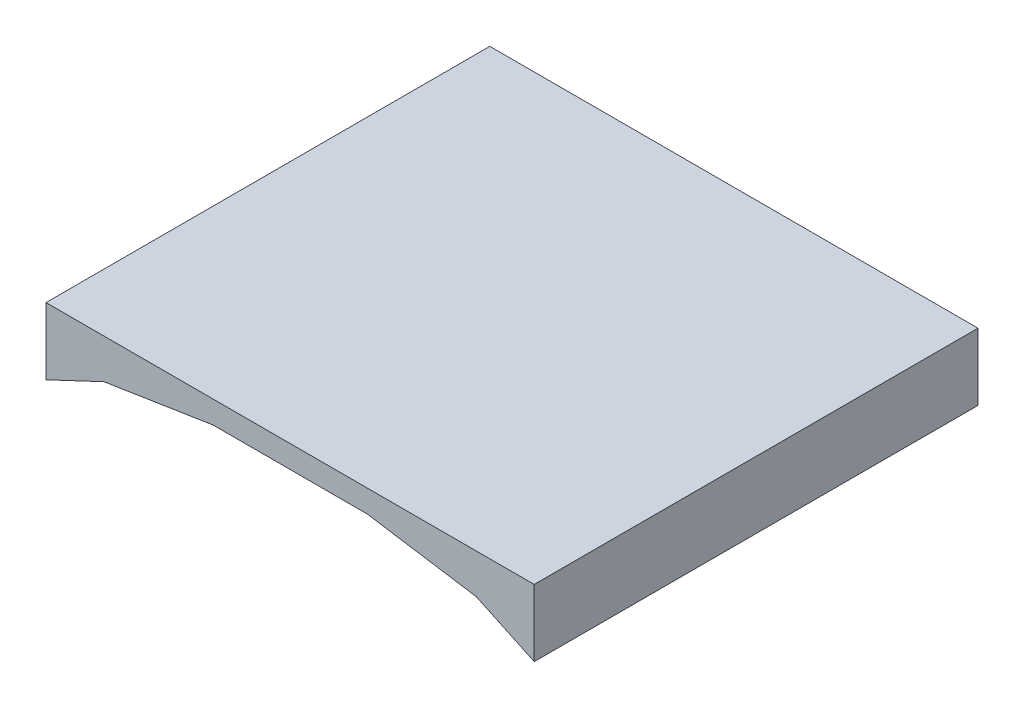
ISO-10303-21;
HEADER;
FILE_DESCRIPTION(('STEP AP214'),'2;1');
FILE_NAME('part.step','',(''),(''),'','','');
FILE_SCHEMA(('AUTOMOTIVE_DESIGN { 1 0 10303 214 1 1 1 1 }'));
ENDSEC;
DATA;
#1=APPLICATION_CONTEXT('core data for automotive mechanical design processes');
#2=APPLICATION_PROTOCOL_DEFINITION('international standard','automotive_design',2000,#1);
#3=PRODUCT_CONTEXT('',#1,'mechanical');
#4=PRODUCT('Part','Part','',(#3));
#5=PRODUCT_RELATED_PRODUCT_CATEGORY('part','',(#4));
#6=PRODUCT_DEFINITION_FORMATION('','',#4);
#7=PRODUCT_DEFINITION_CONTEXT('part definition',#1,'design');
#8=PRODUCT_DEFINITION('design','',#6,#7);
#9=PRODUCT_DEFINITION_SHAPE('','',#8);
#10=(LENGTH_UNIT() NAMED_UNIT(*) SI_UNIT(.MILLI.,.METRE.));
#11=(NAMED_UNIT(*) PLANE_ANGLE_UNIT() SI_UNIT($,.RADIAN.));
#12=(NAMED_UNIT(*) SI_UNIT($,.STERADIAN.) SOLID_ANGLE_UNIT());
#13=UNCERTAINTY_MEASURE_WITH_UNIT(LENGTH_MEASURE(1.E-05),#10,'distance_accuracy_value','');
#14=(GEOMETRIC_REPRESENTATION_CONTEXT(3) GLOBAL_UNCERTAINTY_ASSIGNED_CONTEXT((#13)) GLOBAL_UNIT_ASSIGNED_CONTEXT((#10,
#11,#12)) REPRESENTATION_CONTEXT('',''));
#15=CARTESIAN_POINT('',(0.,0.,0.));
#16=DIRECTION('',(0.,0.,1.));
#17=DIRECTION('',(1.,0.,0.));
#18=AXIS2_PLACEMENT_3D('',#15,#16,#17);
#19=CARTESIAN_POINT('',(-27.5,0.,50.));
#20=DIRECTION('',(1.,0.,0.));
#21=DIRECTION('',(0.,0.,-1.));
#22=AXIS2_PLACEMENT_3D('',#19,#20,#21);
#23=PLANE('',#22);
#24=DIRECTION('',(0.,-1.,0.));
#25=VECTOR('',#24,1.);
#26=CARTESIAN_POINT('',(-27.5,0.,0.));
#27=LINE('',#26,#25);
#28=CARTESIAN_POINT('',(-27.5,7.53596764182063,0.));
#29=VERTEX_POINT('',#28);
#30=CARTESIAN_POINT('',(-27.5,0.,0.));
#31=VERTEX_POINT('',#30);
#32=EDGE_CURVE('E129',#29,#31,#27,.T.);
#33=ORIENTED_EDGE('',*,*,#32,.T.);
#34=DIRECTION('',(0.,0.,-1.));
#35=VECTOR('',#34,1.);
#36=CARTESIAN_POINT('',(-27.5,0.,50.));
#37=LINE('',#36,#35);
#38=CARTESIAN_POINT('',(-27.5,0.,50.));
#39=VERTEX_POINT('',#38);
#40=EDGE_CURVE('E11',#39,#31,#37,.T.);
#41=ORIENTED_EDGE('',*,*,#40,.F.);
#42=DIRECTION('',(0.,-1.,0.));
#43=VECTOR('',#42,1.);
#44=CARTESIAN_POINT('',(-27.5,0.,50.));
#45=LINE('',#44,#43);
#46=CARTESIAN_POINT('',(-27.5,7.53596764182063,50.));
#47=VERTEX_POINT('',#46);
#48=EDGE_CURVE('E143',#47,#39,#45,.T.);
#49=ORIENTED_EDGE('',*,*,#48,.F.);
#50=DIRECTION('',(0.,0.,-1.));
#51=VECTOR('',#50,1.);
#52=CARTESIAN_POINT('',(-27.5,7.53596764182063,50.));
#53=LINE('',#52,#51);
#54=EDGE_CURVE('E125',#47,#29,#53,.T.);
#55=ORIENTED_EDGE('',*,*,#54,.T.);
#56=EDGE_LOOP('',(#33,#41,#49,#55));
#57=FACE_BOUND('',#56,.T.);
#58=ADVANCED_FACE('F33',(#57),#23,.F.);
#59=CARTESIAN_POINT('',(-27.5,0.,50.));
#60=DIRECTION('',(-0.426558237939907,0.90446009842646,0.));
#61=DIRECTION('',(-0.90446009842646,-0.426558237939907,0.));
#62=AXIS2_PLACEMENT_3D('',#59,#60,#61);
#63=PLANE('',#62);
#64=DIRECTION('',(0.90446009842646,0.426558237939907,0.));
#65=VECTOR('',#64,1.);
#66=CARTESIAN_POINT('',(-27.5,0.,0.));
#67=LINE('',#66,#65);
#68=CARTESIAN_POINT('',(-20.9806556570003,3.07462987069468,0.));
#69=VERTEX_POINT('',#68);
#70=EDGE_CURVE('E132',#31,#69,#67,.T.);
#71=ORIENTED_EDGE('',*,*,#70,.T.);
#72=DIRECTION('',(0.,0.,-1.));
#73=VECTOR('',#72,1.);
#74=CARTESIAN_POINT('',(-20.9806556570003,3.07462987069468,50.));
#75=LINE('',#74,#73);
#76=CARTESIAN_POINT('',(-20.9806556570003,3.07462987069468,50.));
#77=VERTEX_POINT('',#76);
#78=EDGE_CURVE('E41',#77,#69,#75,.T.);
#79=ORIENTED_EDGE('',*,*,#78,.F.);
#80=DIRECTION('',(0.90446009842646,0.426558237939907,0.));
#81=VECTOR('',#80,1.);
#82=CARTESIAN_POINT('',(-27.5,0.,50.));
#83=LINE('',#82,#81);
#84=EDGE_CURVE('E92',#39,#77,#83,.T.);
#85=ORIENTED_EDGE('',*,*,#84,.F.);
#86=ORIENTED_EDGE('',*,*,#40,.T.);
#87=EDGE_LOOP('',(#71,#79,#85,#86));
#88=FACE_BOUND('',#87,.T.);
#89=ADVANCED_FACE('F178',(#88),#63,.F.);
#90=CARTESIAN_POINT('',(-20.9806556570003,3.07462987069468,50.));
#91=DIRECTION('',(-0.154704315530748,0.987960816407292,0.));
#92=DIRECTION('',(-0.987960816407292,-0.154704315530748,0.));
#93=AXIS2_PLACEMENT_3D('',#90,#91,#92);
#94=PLANE('',#93);
#95=DIRECTION('',(0.987960816407292,0.154704315530748,0.));
#96=VECTOR('',#95,1.);
#97=CARTESIAN_POINT('',(-20.9806556570003,3.07462987069468,0.));
#98=LINE('',#97,#96);
#99=CARTESIAN_POINT('',(-8.68500483233645,5.,0.));
#100=VERTEX_POINT('',#99);
#101=EDGE_CURVE('E134',#69,#100,#98,.T.);
#102=ORIENTED_EDGE('',*,*,#101,.T.);
#103=DIRECTION('',(0.,0.,-1.));
#104=VECTOR('',#103,1.);
#105=CARTESIAN_POINT('',(-8.68500483233645,5.,50.));
#106=LINE('',#105,#104);
#107=CARTESIAN_POINT('',(-8.68500483233645,5.,50.));
#108=VERTEX_POINT('',#107);
#109=EDGE_CURVE('E150',#108,#100,#106,.T.);
#110=ORIENTED_EDGE('',*,*,#109,.F.);
#111=DIRECTION('',(0.987960816407292,0.154704315530748,0.));
#112=VECTOR('',#111,1.);
#113=CARTESIAN_POINT('',(-20.9806556570003,3.07462987069468,50.));
#114=LINE('',#113,#112);
#115=EDGE_CURVE('E158',#77,#108,#114,.T.);
#116=ORIENTED_EDGE('',*,*,#115,.F.);
#117=ORIENTED_EDGE('',*,*,#78,.T.);
#118=EDGE_LOOP('',(#102,#110,#116,#117));
#119=FACE_BOUND('',#118,.T.);
#120=ADVANCED_FACE('F156',(#119),#94,.F.);
#121=CARTESIAN_POINT('',(-8.68500483233645,5.,50.));
#122=DIRECTION('',(0.,1.,0.));
#123=DIRECTION('',(0.,0.,1.));
#124=AXIS2_PLACEMENT_3D('',#121,#122,#123);
#125=PLANE('',#124);
#126=DIRECTION('',(1.,0.,0.));
#127=VECTOR('',#126,1.);
#128=CARTESIAN_POINT('',(-8.68500483233645,5.,0.));
#129=LINE('',#128,#127);
#130=CARTESIAN_POINT('',(8.68500483233645,5.,0.));
#131=VERTEX_POINT('',#130);
#132=EDGE_CURVE('E136',#100,#131,#129,.T.);
#133=ORIENTED_EDGE('',*,*,#132,.T.);
#134=DIRECTION('',(0.,0.,-1.));
#135=VECTOR('',#134,1.);
#136=CARTESIAN_POINT('',(8.68500483233645,5.,50.));
#137=LINE('',#136,#135);
#138=CARTESIAN_POINT('',(8.68500483233645,5.,50.));
#139=VERTEX_POINT('',#138);
#140=EDGE_CURVE('E147',#139,#131,#137,.T.);
#141=ORIENTED_EDGE('',*,*,#140,.F.);
#142=DIRECTION('',(1.,0.,0.));
#143=VECTOR('',#142,1.);
#144=CARTESIAN_POINT('',(-8.68500483233645,5.,50.));
#145=LINE('',#144,#143);
#146=EDGE_CURVE('E170',#108,#139,#145,.T.);
#147=ORIENTED_EDGE('',*,*,#146,.F.);
#148=ORIENTED_EDGE('',*,*,#109,.T.);
#149=EDGE_LOOP('',(#133,#141,#147,#148));
#150=FACE_BOUND('',#149,.T.);
#151=ADVANCED_FACE('F166',(#150),#125,.F.);
#152=CARTESIAN_POINT('',(20.9806556570003,3.07462987069468,50.));
#153=DIRECTION('',(0.154704315530748,0.987960816407292,0.));
#154=DIRECTION('',(-0.987960816407292,0.154704315530748,0.));
#155=AXIS2_PLACEMENT_3D('',#152,#153,#154);
#156=PLANE('',#155);
#157=DIRECTION('',(0.987960816407292,-0.154704315530748,0.));
#158=VECTOR('',#157,1.);
#159=CARTESIAN_POINT('',(20.9806556570003,3.07462987069468,0.));
#160=LINE('',#159,#158);
#161=CARTESIAN_POINT('',(20.9806556570003,3.07462987069468,0.));
#162=VERTEX_POINT('',#161);
#163=EDGE_CURVE('E138',#131,#162,#160,.T.);
#164=ORIENTED_EDGE('',*,*,#163,.T.);
#165=DIRECTION('',(0.,0.,-1.));
#166=VECTOR('',#165,1.);
#167=CARTESIAN_POINT('',(20.9806556570003,3.07462987069468,50.));
#168=LINE('',#167,#166);
#169=CARTESIAN_POINT('',(20.9806556570003,3.07462987069468,50.));
#170=VERTEX_POINT('',#169);
#171=EDGE_CURVE('E120',#170,#162,#168,.T.);
#172=ORIENTED_EDGE('',*,*,#171,.F.);
#173=DIRECTION('',(0.987960816407292,-0.154704315530748,0.));
#174=VECTOR('',#173,1.);
#175=CARTESIAN_POINT('',(20.9806556570003,3.07462987069468,50.));
#176=LINE('',#175,#174);
#177=EDGE_CURVE('E111',#139,#170,#176,.T.);
#178=ORIENTED_EDGE('',*,*,#177,.F.);
#179=ORIENTED_EDGE('',*,*,#140,.T.);
#180=EDGE_LOOP('',(#164,#172,#178,#179));
#181=FACE_BOUND('',#180,.T.);
#182=ADVANCED_FACE('F169',(#181),#156,.F.);
#183=CARTESIAN_POINT('',(27.5,0.,50.));
#184=DIRECTION('',(0.426558237939907,0.90446009842646,0.));
#185=DIRECTION('',(-0.90446009842646,0.426558237939907,0.));
#186=AXIS2_PLACEMENT_3D('',#183,#184,#185);
#187=PLANE('',#186);
#188=DIRECTION('',(0.90446009842646,-0.426558237939907,0.));
#189=VECTOR('',#188,1.);
#190=CARTESIAN_POINT('',(27.5,0.,0.));
#191=LINE('',#190,#189);
#192=CARTESIAN_POINT('',(27.5,0.,0.));
#193=VERTEX_POINT('',#192);
#194=EDGE_CURVE('E119',#162,#193,#191,.T.);
#195=ORIENTED_EDGE('',*,*,#194,.T.);
#196=DIRECTION('',(0.,0.,-1.));
#197=VECTOR('',#196,1.);
#198=CARTESIAN_POINT('',(27.5,0.,50.));
#199=LINE('',#198,#197);
#200=CARTESIAN_POINT('',(27.5,0.,50.));
#201=VERTEX_POINT('',#200);
#202=EDGE_CURVE('E116',#201,#193,#199,.T.);
#203=ORIENTED_EDGE('',*,*,#202,.F.);
#204=DIRECTION('',(0.90446009842646,-0.426558237939907,0.));
#205=VECTOR('',#204,1.);
#206=CARTESIAN_POINT('',(27.5,0.,50.));
#207=LINE('',#206,#205);
#208=EDGE_CURVE('E105',#170,#201,#207,.T.);
#209=ORIENTED_EDGE('',*,*,#208,.F.);
#210=ORIENTED_EDGE('',*,*,#171,.T.);
#211=EDGE_LOOP('',(#195,#203,#209,#210));
#212=FACE_BOUND('',#211,.T.);
#213=ADVANCED_FACE('F117',(#212),#187,.F.);
#214=CARTESIAN_POINT('',(27.5,7.53596764182063,50.));
#215=DIRECTION('',(-1.,0.,0.));
#216=DIRECTION('',(0.,0.,1.));
#217=AXIS2_PLACEMENT_3D('',#214,#215,#216);
#218=PLANE('',#217);
#219=DIRECTION('',(0.,1.,0.));
#220=VECTOR('',#219,1.);
#221=CARTESIAN_POINT('',(27.5,7.53596764182063,0.));
#222=LINE('',#221,#220);
#223=CARTESIAN_POINT('',(27.5,7.53596764182063,0.));
#224=VERTEX_POINT('',#223);
#225=EDGE_CURVE('E78',#193,#224,#222,.T.);
#226=ORIENTED_EDGE('',*,*,#225,.T.);
#227=DIRECTION('',(0.,0.,-1.));
#228=VECTOR('',#227,1.);
#229=CARTESIAN_POINT('',(27.5,7.53596764182063,50.));
#230=LINE('',#229,#228);
#231=CARTESIAN_POINT('',(27.5,7.53596764182063,50.));
#232=VERTEX_POINT('',#231);
#233=EDGE_CURVE('E121',#232,#224,#230,.T.);
#234=ORIENTED_EDGE('',*,*,#233,.F.);
#235=DIRECTION('',(0.,1.,0.));
#236=VECTOR('',#235,1.);
#237=CARTESIAN_POINT('',(27.5,7.53596764182063,50.));
#238=LINE('',#237,#236);
#239=EDGE_CURVE('E109',#201,#232,#238,.T.);
#240=ORIENTED_EDGE('',*,*,#239,.F.);
#241=ORIENTED_EDGE('',*,*,#202,.T.);
#242=EDGE_LOOP('',(#226,#234,#240,#241));
#243=FACE_BOUND('',#242,.T.);
#244=ADVANCED_FACE('F123',(#243),#218,.F.);
#245=CARTESIAN_POINT('',(-27.5,7.53596764182063,50.));
#246=DIRECTION('',(0.,-1.,0.));
#247=DIRECTION('',(0.,0.,-1.));
#248=AXIS2_PLACEMENT_3D('',#245,#246,#247);
#249=PLANE('',#248);
#250=DIRECTION('',(-1.,0.,0.));
#251=VECTOR('',#250,1.);
#252=CARTESIAN_POINT('',(-27.5,7.53596764182063,0.));
#253=LINE('',#252,#251);
#254=EDGE_CURVE('E84',#224,#29,#253,.T.);
#255=ORIENTED_EDGE('',*,*,#254,.T.);
#256=ORIENTED_EDGE('',*,*,#54,.F.);
#257=DIRECTION('',(-1.,0.,0.));
#258=VECTOR('',#257,1.);
#259=CARTESIAN_POINT('',(-27.5,7.53596764182063,50.));
#260=LINE('',#259,#258);
#261=EDGE_CURVE('E49',#232,#47,#260,.T.);
#262=ORIENTED_EDGE('',*,*,#261,.F.);
#263=ORIENTED_EDGE('',*,*,#233,.T.);
#264=EDGE_LOOP('',(#255,#256,#262,#263));
#265=FACE_BOUND('',#264,.T.);
#266=ADVANCED_FACE('F194',(#265),#249,.F.);
#267=CARTESIAN_POINT('',(0.,0.,50.));
#268=DIRECTION('',(0.,0.,-1.));
#269=DIRECTION('',(-1.,0.,0.));
#270=AXIS2_PLACEMENT_3D('',#267,#268,#269);
#271=PLANE('',#270);
#272=ORIENTED_EDGE('',*,*,#48,.T.);
#273=ORIENTED_EDGE('',*,*,#84,.T.);
#274=ORIENTED_EDGE('',*,*,#115,.T.);
#275=ORIENTED_EDGE('',*,*,#146,.T.);
#276=ORIENTED_EDGE('',*,*,#177,.T.);
#277=ORIENTED_EDGE('',*,*,#208,.T.);
#278=ORIENTED_EDGE('',*,*,#239,.T.);
#279=ORIENTED_EDGE('',*,*,#261,.T.);
#280=EDGE_LOOP('',(#272,#273,#274,#275,#276,#277,#278,#279));
#281=FACE_BOUND('',#280,.T.);
#282=ADVANCED_FACE('F107',(#281),#271,.F.);
#283=CARTESIAN_POINT('',(0.,0.,0.));
#284=DIRECTION('',(0.,0.,-1.));
#285=DIRECTION('',(-1.,0.,0.));
#286=AXIS2_PLACEMENT_3D('',#283,#284,#285);
#287=PLANE('',#286);
#288=ORIENTED_EDGE('',*,*,#32,.F.);
#289=ORIENTED_EDGE('',*,*,#254,.F.);
#290=ORIENTED_EDGE('',*,*,#225,.F.);
#291=ORIENTED_EDGE('',*,*,#194,.F.);
#292=ORIENTED_EDGE('',*,*,#163,.F.);
#293=ORIENTED_EDGE('',*,*,#132,.F.);
#294=ORIENTED_EDGE('',*,*,#101,.F.);
#295=ORIENTED_EDGE('',*,*,#70,.F.);
#296=EDGE_LOOP('',(#288,#289,#290,#291,#292,#293,#294,#295));
#297=FACE_BOUND('',#296,.T.);
#298=ADVANCED_FACE('F162',(#297),#287,.T.);
#299=CLOSED_SHELL('',(#58,#89,#120,#151,#182,#213,#244,#266,#282,#298));
#300=MANIFOLD_SOLID_BREP('B2',#299);
#301=ADVANCED_BREP_SHAPE_REPRESENTATION('',(#18,#300),#14);
#302=SHAPE_DEFINITION_REPRESENTATION(#9,#301);
ENDSEC;
END-ISO-10303-21;
